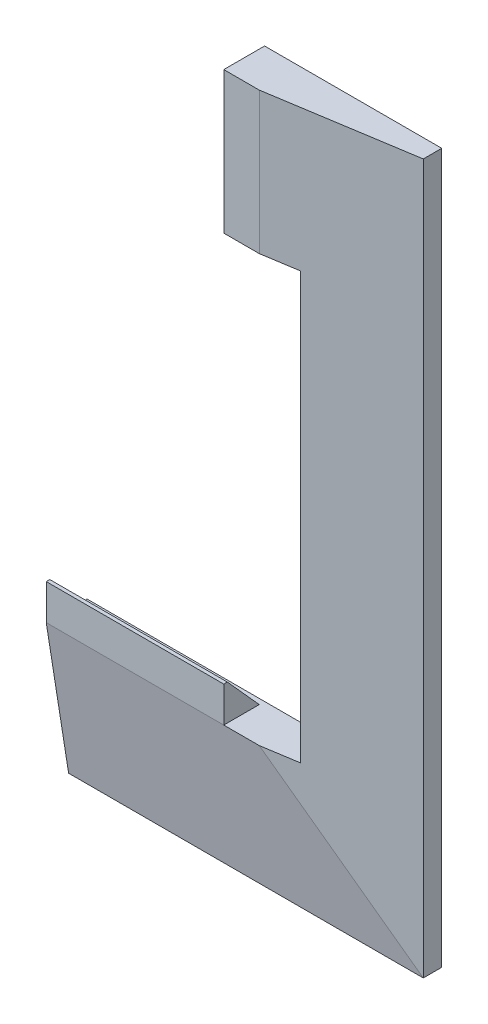
ISO-10303-21;
HEADER;
FILE_DESCRIPTION(('STEP AP214'),'2;1');
FILE_NAME('part.step','',(''),(''),'','','');
FILE_SCHEMA(('AUTOMOTIVE_DESIGN { 1 0 10303 214 1 1 1 1 }'));
ENDSEC;
DATA;
#1=APPLICATION_CONTEXT('core data for automotive mechanical design processes');
#2=APPLICATION_PROTOCOL_DEFINITION('international standard','automotive_design',2000,#1);
#3=PRODUCT_CONTEXT('',#1,'mechanical');
#4=PRODUCT('Part','Part','',(#3));
#5=PRODUCT_RELATED_PRODUCT_CATEGORY('part','',(#4));
#6=PRODUCT_DEFINITION_FORMATION('','',#4);
#7=PRODUCT_DEFINITION_CONTEXT('part definition',#1,'design');
#8=PRODUCT_DEFINITION('design','',#6,#7);
#9=PRODUCT_DEFINITION_SHAPE('','',#8);
#10=(LENGTH_UNIT() NAMED_UNIT(*) SI_UNIT(.MILLI.,.METRE.));
#11=(NAMED_UNIT(*) PLANE_ANGLE_UNIT() SI_UNIT($,.RADIAN.));
#12=(NAMED_UNIT(*) SI_UNIT($,.STERADIAN.) SOLID_ANGLE_UNIT());
#13=UNCERTAINTY_MEASURE_WITH_UNIT(LENGTH_MEASURE(1.E-05),#10,'distance_accuracy_value','');
#14=(GEOMETRIC_REPRESENTATION_CONTEXT(3) GLOBAL_UNCERTAINTY_ASSIGNED_CONTEXT((#13)) GLOBAL_UNIT_ASSIGNED_CONTEXT((#10,
#11,#12)) REPRESENTATION_CONTEXT('',''));
#15=CARTESIAN_POINT('',(0.,0.,0.));
#16=DIRECTION('',(0.,0.,1.));
#17=DIRECTION('',(1.,0.,0.));
#18=AXIS2_PLACEMENT_3D('',#15,#16,#17);
#19=CARTESIAN_POINT('',(53.4329718987957,83.245366469038,5.2));
#20=DIRECTION('',(1.,0.,0.));
#21=DIRECTION('',(0.,-1.,0.));
#22=AXIS2_PLACEMENT_3D('',#19,#20,#21);
#23=PLANE('',#22);
#24=DIRECTION('',(0.,-0.987762965329069,-0.155962573473011));
#25=VECTOR('',#24,1.);
#26=CARTESIAN_POINT('',(53.4329718987957,-76.654633530962,11.5));
#27=LINE('',#26,#25);
#28=CARTESIAN_POINT('',(53.4329718987957,-76.654633530962,11.5));
#29=VERTEX_POINT('',#28);
#30=CARTESIAN_POINT('',(53.4329718987958,-116.554633530962,5.2));
#31=VERTEX_POINT('',#30);
#32=EDGE_CURVE('E580',#29,#31,#27,.T.);
#33=ORIENTED_EDGE('',*,*,#32,.F.);
#34=DIRECTION('',(0.,1.,0.));
#35=VECTOR('',#34,1.);
#36=CARTESIAN_POINT('',(53.4329718987957,-66.654633530962,11.5));
#37=LINE('',#36,#35);
#38=CARTESIAN_POINT('',(53.4329718987957,-66.654633530962,11.5));
#39=VERTEX_POINT('',#38);
#40=EDGE_CURVE('E268',#29,#39,#37,.T.);
#41=ORIENTED_EDGE('',*,*,#40,.T.);
#42=DIRECTION('',(0.,0.,-1.));
#43=VECTOR('',#42,1.);
#44=CARTESIAN_POINT('',(53.4329718987957,-66.654633530962,10.5));
#45=LINE('',#44,#43);
#46=CARTESIAN_POINT('',(53.4329718987957,-66.654633530962,10.5));
#47=VERTEX_POINT('',#46);
#48=EDGE_CURVE('E235',#39,#47,#45,.T.);
#49=ORIENTED_EDGE('',*,*,#48,.T.);
#50=DIRECTION('',(0.,-0.743294146247167,-0.668964731622449));
#51=VECTOR('',#50,1.);
#52=CARTESIAN_POINT('',(53.4329718987957,-76.654633530962,1.5));
#53=LINE('',#52,#51);
#54=CARTESIAN_POINT('',(53.4329718987957,-76.654633530962,1.5));
#55=VERTEX_POINT('',#54);
#56=EDGE_CURVE('E257',#47,#55,#53,.T.);
#57=ORIENTED_EDGE('',*,*,#56,.T.);
#58=DIRECTION('',(0.,0.,-1.));
#59=VECTOR('',#58,1.);
#60=CARTESIAN_POINT('',(53.4329718987957,-76.654633530962,5.2));
#61=LINE('',#60,#59);
#62=CARTESIAN_POINT('',(53.4329718987957,-76.654633530962,0.));
#63=VERTEX_POINT('',#62);
#64=EDGE_CURVE('E439',#55,#63,#61,.T.);
#65=ORIENTED_EDGE('',*,*,#64,.T.);
#66=DIRECTION('',(0.,1.,0.));
#67=VECTOR('',#66,1.);
#68=CARTESIAN_POINT('',(53.4329718987957,-76.654633530962,0.));
#69=LINE('',#68,#67);
#70=CARTESIAN_POINT('',(53.4329718987958,-116.554633530962,0.));
#71=VERTEX_POINT('',#70);
#72=EDGE_CURVE('E527',#71,#63,#69,.T.);
#73=ORIENTED_EDGE('',*,*,#72,.F.);
#74=DIRECTION('',(0.,0.,-1.));
#75=VECTOR('',#74,1.);
#76=CARTESIAN_POINT('',(53.4329718987958,-116.554633530962,5.2));
#77=LINE('',#76,#75);
#78=EDGE_CURVE('E443',#31,#71,#77,.T.);
#79=ORIENTED_EDGE('',*,*,#78,.F.);
#80=EDGE_LOOP('',(#33,#41,#49,#57,#65,#73,#79));
#81=FACE_BOUND('',#80,.T.);
#82=ADVANCED_FACE('F61',(#81),#23,.F.);
#83=CARTESIAN_POINT('',(71.9758043168466,0.,11.5));
#84=DIRECTION('',(0.,0.,-1.));
#85=DIRECTION('',(1.,0.,0.));
#86=AXIS2_PLACEMENT_3D('',#83,#84,#85);
#87=PLANE('',#86);
#88=DIRECTION('',(1.,0.,0.));
#89=VECTOR('',#88,1.);
#90=CARTESIAN_POINT('',(71.9758043168466,43.345366469038,11.5));
#91=LINE('',#90,#89);
#92=CARTESIAN_POINT('',(103.432971898796,43.345366469038,11.5));
#93=VERTEX_POINT('',#92);
#94=CARTESIAN_POINT('',(113.432971898796,43.345366469038,11.5));
#95=VERTEX_POINT('',#94);
#96=EDGE_CURVE('E362',#93,#95,#91,.T.);
#97=ORIENTED_EDGE('',*,*,#96,.T.);
#98=CARTESIAN_POINT('',(113.432971898796,83.245366469038,11.5));
#99=DIRECTION('',(0.,-1.,0.));
#100=VECTOR('',#99,1.);
#101=LINE('',#98,#100);
#102=CARTESIAN_POINT('',(113.432971898796,83.245366469038,11.5));
#103=VERTEX_POINT('',#102);
#104=EDGE_CURVE('E591',#103,#95,#101,.T.);
#105=ORIENTED_EDGE('',*,*,#104,.F.);
#106=CARTESIAN_POINT('',(103.432971898796,83.245366469038,11.5));
#107=DIRECTION('',(1.,0.,0.));
#108=VECTOR('',#107,1.);
#109=LINE('',#106,#108);
#110=CARTESIAN_POINT('',(103.432971898796,83.245366469038,11.5));
#111=VERTEX_POINT('',#110);
#112=EDGE_CURVE('E426',#111,#103,#109,.T.);
#113=ORIENTED_EDGE('',*,*,#112,.F.);
#114=DIRECTION('',(0.,-1.,0.));
#115=VECTOR('',#114,1.);
#116=CARTESIAN_POINT('',(103.432971898796,83.245366469038,11.5));
#117=LINE('',#116,#115);
#118=EDGE_CURVE('E279',#111,#93,#117,.T.);
#119=ORIENTED_EDGE('',*,*,#118,.T.);
#120=EDGE_LOOP('',(#97,#105,#113,#119));
#121=FACE_BOUND('',#120,.T.);
#122=ADVANCED_FACE('F499',(#121),#87,.F.);
#123=CARTESIAN_POINT('',(74.7558435282994,0.,17.6069150058678));
#124=DIRECTION('',(0.155962573473011,0.,0.987762965329069));
#125=DIRECTION('',(-0.987762965329069,0.,0.155962573473011));
#126=AXIS2_PLACEMENT_3D('',#123,#124,#125);
#127=PLANE('',#126);
#128=DIRECTION('',(0.,-1.,0.));
#129=VECTOR('',#128,1.);
#130=CARTESIAN_POINT('',(123.432971898796,0.,9.92105263157894));
#131=LINE('',#130,#129);
#132=CARTESIAN_POINT('',(123.432971898796,43.345366469038,9.92105263157894));
#133=VERTEX_POINT('',#132);
#134=CARTESIAN_POINT('',(123.432971898796,-76.654633530962,9.92105263157894));
#135=VERTEX_POINT('',#134);
#136=EDGE_CURVE('E459',#133,#135,#131,.T.);
#137=ORIENTED_EDGE('',*,*,#136,.T.);
#138=DIRECTION('',(0.987762965329069,0.,-0.155962573473011));
#139=VECTOR('',#138,1.);
#140=CARTESIAN_POINT('',(74.7558435282994,-76.654633530962,17.6069150058678));
#141=LINE('',#140,#139);
#142=CARTESIAN_POINT('',(113.432971898796,-76.654633530962,11.5));
#143=VERTEX_POINT('',#142);
#144=EDGE_CURVE('E571',#143,#135,#141,.T.);
#145=ORIENTED_EDGE('',*,*,#144,.F.);
#146=DIRECTION('',(0.702740385382544,-0.702740385382543,-0.110959008218296));
#147=VECTOR('',#146,1.);
#148=CARTESIAN_POINT('',(113.432971898796,-76.654633530962,11.5));
#149=LINE('',#148,#147);
#150=CARTESIAN_POINT('',(153.332971898796,-116.554633530962,5.2));
#151=VERTEX_POINT('',#150);
#152=EDGE_CURVE('E539',#143,#151,#149,.T.);
#153=ORIENTED_EDGE('',*,*,#152,.T.);
#154=DIRECTION('',(0.,1.,0.));
#155=VECTOR('',#154,1.);
#156=CARTESIAN_POINT('',(153.332971898796,0.,5.2));
#157=LINE('',#156,#155);
#158=CARTESIAN_POINT('',(153.332971898796,83.245366469038,5.2));
#159=VERTEX_POINT('',#158);
#160=EDGE_CURVE('E470',#159,#151,#157,.F.);
#161=ORIENTED_EDGE('',*,*,#160,.F.);
#162=DIRECTION('',(0.987762965329069,0.,-0.155962573473011));
#163=VECTOR('',#162,1.);
#164=CARTESIAN_POINT('',(113.432971898796,83.245366469038,11.5));
#165=LINE('',#164,#163);
#166=EDGE_CURVE('E535',#103,#159,#165,.T.);
#167=ORIENTED_EDGE('',*,*,#166,.F.);
#168=ORIENTED_EDGE('',*,*,#104,.T.);
#169=DIRECTION('',(-0.987762965329069,0.,0.155962573473011));
#170=VECTOR('',#169,1.);
#171=CARTESIAN_POINT('',(74.7558435282994,43.345366469038,17.6069150058678));
#172=LINE('',#171,#170);
#173=EDGE_CURVE('E636',#133,#95,#172,.T.);
#174=ORIENTED_EDGE('',*,*,#173,.F.);
#175=EDGE_LOOP('',(#137,#145,#153,#161,#167,#168,#174));
#176=FACE_BOUND('',#175,.T.);
#177=ADVANCED_FACE('F517',(#176),#127,.T.);
#178=CARTESIAN_POINT('',(153.332971898796,83.245366469038,5.2));
#179=DIRECTION('',(-1.,0.,0.));
#180=DIRECTION('',(0.,1.,0.));
#181=AXIS2_PLACEMENT_3D('',#178,#179,#180);
#182=PLANE('',#181);
#183=DIRECTION('',(0.,-1.,0.));
#184=VECTOR('',#183,1.);
#185=CARTESIAN_POINT('',(153.332971898796,83.245366469038,0.));
#186=LINE('',#185,#184);
#187=CARTESIAN_POINT('',(153.332971898796,83.245366469038,0.));
#188=VERTEX_POINT('',#187);
#189=CARTESIAN_POINT('',(153.332971898796,-116.554633530962,0.));
#190=VERTEX_POINT('',#189);
#191=EDGE_CURVE('E528',#188,#190,#186,.T.);
#192=ORIENTED_EDGE('',*,*,#191,.F.);
#193=DIRECTION('',(0.,0.,-1.));
#194=VECTOR('',#193,1.);
#195=CARTESIAN_POINT('',(153.332971898796,83.245366469038,5.2));
#196=LINE('',#195,#194);
#197=EDGE_CURVE('E460',#159,#188,#196,.T.);
#198=ORIENTED_EDGE('',*,*,#197,.F.);
#199=ORIENTED_EDGE('',*,*,#160,.T.);
#200=DIRECTION('',(0.,0.,-1.));
#201=VECTOR('',#200,1.);
#202=CARTESIAN_POINT('',(153.332971898796,-116.554633530962,5.2));
#203=LINE('',#202,#201);
#204=EDGE_CURVE('E453',#151,#190,#203,.T.);
#205=ORIENTED_EDGE('',*,*,#204,.T.);
#206=EDGE_LOOP('',(#192,#198,#199,#205));
#207=FACE_BOUND('',#206,.T.);
#208=ADVANCED_FACE('F63',(#207),#182,.F.);
#209=CARTESIAN_POINT('',(153.332971898796,-116.554633530962,5.2));
#210=DIRECTION('',(0.,1.,0.));
#211=DIRECTION('',(1.,0.,0.));
#212=AXIS2_PLACEMENT_3D('',#209,#210,#211);
#213=PLANE('',#212);
#214=DIRECTION('',(-1.,0.,0.));
#215=VECTOR('',#214,1.);
#216=CARTESIAN_POINT('',(153.332971898796,-116.554633530962,0.));
#217=LINE('',#216,#215);
#218=EDGE_CURVE('E520',#190,#71,#217,.T.);
#219=ORIENTED_EDGE('',*,*,#218,.F.);
#220=ORIENTED_EDGE('',*,*,#204,.F.);
#221=DIRECTION('',(-1.,0.,0.));
#222=VECTOR('',#221,1.);
#223=CARTESIAN_POINT('',(71.9758043168466,-116.554633530962,5.2));
#224=LINE('',#223,#222);
#225=EDGE_CURVE('E465',#151,#31,#224,.T.);
#226=ORIENTED_EDGE('',*,*,#225,.T.);
#227=ORIENTED_EDGE('',*,*,#78,.T.);
#228=EDGE_LOOP('',(#219,#220,#226,#227));
#229=FACE_BOUND('',#228,.T.);
#230=ADVANCED_FACE('F510',(#229),#213,.F.);
#231=CARTESIAN_POINT('',(123.432971898796,-76.654633530962,5.2));
#232=DIRECTION('',(0.,-1.,0.));
#233=DIRECTION('',(-1.,0.,0.));
#234=AXIS2_PLACEMENT_3D('',#231,#232,#233);
#235=PLANE('',#234);
#236=ORIENTED_EDGE('',*,*,#64,.F.);
#237=DIRECTION('',(-1.,0.,0.));
#238=VECTOR('',#237,1.);
#239=CARTESIAN_POINT('',(103.432971898796,-76.654633530962,1.5));
#240=LINE('',#239,#238);
#241=CARTESIAN_POINT('',(103.432971898796,-76.654633530962,1.5));
#242=VERTEX_POINT('',#241);
#243=EDGE_CURVE('E270',#242,#55,#240,.T.);
#244=ORIENTED_EDGE('',*,*,#243,.F.);
#245=DIRECTION('',(0.,0.,1.));
#246=VECTOR('',#245,1.);
#247=CARTESIAN_POINT('',(103.432971898796,-76.654633530962,11.5));
#248=LINE('',#247,#246);
#249=CARTESIAN_POINT('',(103.432971898796,-76.654633530962,11.5));
#250=VERTEX_POINT('',#249);
#251=EDGE_CURVE('E241',#242,#250,#248,.T.);
#252=ORIENTED_EDGE('',*,*,#251,.T.);
#253=DIRECTION('',(-1.,0.,0.));
#254=VECTOR('',#253,1.);
#255=CARTESIAN_POINT('',(113.432971898796,-76.654633530962,11.5));
#256=LINE('',#255,#254);
#257=EDGE_CURVE('E585',#143,#250,#256,.T.);
#258=ORIENTED_EDGE('',*,*,#257,.F.);
#259=ORIENTED_EDGE('',*,*,#144,.T.);
#260=DIRECTION('',(0.,0.,-1.));
#261=VECTOR('',#260,1.);
#262=CARTESIAN_POINT('',(123.432971898796,-76.654633530962,5.2));
#263=LINE('',#262,#261);
#264=CARTESIAN_POINT('',(123.432971898796,-76.654633530962,0.));
#265=VERTEX_POINT('',#264);
#266=EDGE_CURVE('E444',#135,#265,#263,.T.);
#267=ORIENTED_EDGE('',*,*,#266,.T.);
#268=DIRECTION('',(1.,0.,0.));
#269=VECTOR('',#268,1.);
#270=CARTESIAN_POINT('',(123.432971898796,-76.654633530962,0.));
#271=LINE('',#270,#269);
#272=EDGE_CURVE('E549',#63,#265,#271,.T.);
#273=ORIENTED_EDGE('',*,*,#272,.F.);
#274=EDGE_LOOP('',(#236,#244,#252,#258,#259,#267,#273));
#275=FACE_BOUND('',#274,.T.);
#276=ADVANCED_FACE('F507',(#275),#235,.F.);
#277=CARTESIAN_POINT('',(123.432971898796,43.345366469038,5.2));
#278=DIRECTION('',(1.,0.,0.));
#279=DIRECTION('',(0.,-1.,0.));
#280=AXIS2_PLACEMENT_3D('',#277,#278,#279);
#281=PLANE('',#280);
#282=DIRECTION('',(0.,1.,0.));
#283=VECTOR('',#282,1.);
#284=CARTESIAN_POINT('',(123.432971898796,43.345366469038,0.));
#285=LINE('',#284,#283);
#286=CARTESIAN_POINT('',(123.432971898796,43.345366469038,0.));
#287=VERTEX_POINT('',#286);
#288=EDGE_CURVE('E553',#265,#287,#285,.T.);
#289=ORIENTED_EDGE('',*,*,#288,.F.);
#290=ORIENTED_EDGE('',*,*,#266,.F.);
#291=ORIENTED_EDGE('',*,*,#136,.F.);
#292=DIRECTION('',(0.,0.,-1.));
#293=VECTOR('',#292,1.);
#294=CARTESIAN_POINT('',(123.432971898796,43.345366469038,5.2));
#295=LINE('',#294,#293);
#296=EDGE_CURVE('E464',#133,#287,#295,.T.);
#297=ORIENTED_EDGE('',*,*,#296,.T.);
#298=EDGE_LOOP('',(#289,#290,#291,#297));
#299=FACE_BOUND('',#298,.T.);
#300=CARTESIAN_POINT('',(123.432971898796,3.24536646903798,5.12));
#301=DIRECTION('',(1.,0.,0.));
#302=DIRECTION('',(0.,1.,0.));
#303=AXIS2_PLACEMENT_3D('',#300,#301,#302);
#304=CIRCLE('',#303,1.2);
#305=CARTESIAN_POINT('',(123.432971898796,4.44536646903798,5.12));
#306=VERTEX_POINT('',#305);
#307=EDGE_CURVE('E306',#306,#306,#304,.T.);
#308=ORIENTED_EDGE('',*,*,#307,.T.);
#309=EDGE_LOOP('',(#308));
#310=FACE_BOUND('',#309,.T.);
#311=CARTESIAN_POINT('',(123.432971898796,-36.554633530962,5.12));
#312=DIRECTION('',(1.,0.,0.));
#313=DIRECTION('',(0.,1.,0.));
#314=AXIS2_PLACEMENT_3D('',#311,#312,#313);
#315=CIRCLE('',#314,1.2);
#316=CARTESIAN_POINT('',(123.432971898796,-35.354633530962,5.12));
#317=VERTEX_POINT('',#316);
#318=EDGE_CURVE('E280',#317,#317,#315,.T.);
#319=ORIENTED_EDGE('',*,*,#318,.T.);
#320=EDGE_LOOP('',(#319));
#321=FACE_BOUND('',#320,.T.);
#322=ADVANCED_FACE('F503',(#299,#310,#321),#281,.F.);
#323=CARTESIAN_POINT('',(123.432971898796,43.345366469038,5.2));
#324=DIRECTION('',(0.,1.,0.));
#325=DIRECTION('',(0.,0.,1.));
#326=AXIS2_PLACEMENT_3D('',#323,#324,#325);
#327=PLANE('',#326);
#328=DIRECTION('',(-1.,0.,0.));
#329=VECTOR('',#328,1.);
#330=CARTESIAN_POINT('',(123.432971898796,43.345366469038,0.));
#331=LINE('',#330,#329);
#332=CARTESIAN_POINT('',(103.432971898796,43.345366469038,0.));
#333=VERTEX_POINT('',#332);
#334=EDGE_CURVE('E557',#287,#333,#331,.T.);
#335=ORIENTED_EDGE('',*,*,#334,.F.);
#336=ORIENTED_EDGE('',*,*,#296,.F.);
#337=ORIENTED_EDGE('',*,*,#173,.T.);
#338=ORIENTED_EDGE('',*,*,#96,.F.);
#339=DIRECTION('',(0.,0.,1.));
#340=VECTOR('',#339,1.);
#341=CARTESIAN_POINT('',(103.432971898796,43.345366469038,-12.5));
#342=LINE('',#341,#340);
#343=EDGE_CURVE('E275',#333,#93,#342,.T.);
#344=ORIENTED_EDGE('',*,*,#343,.F.);
#345=EDGE_LOOP('',(#335,#336,#337,#338,#344));
#346=FACE_BOUND('',#345,.T.);
#347=ADVANCED_FACE('F494',(#346),#327,.F.);
#348=CARTESIAN_POINT('',(153.332971898796,83.245366469038,5.2));
#349=DIRECTION('',(0.,-1.,0.));
#350=DIRECTION('',(-1.,0.,0.));
#351=AXIS2_PLACEMENT_3D('',#348,#349,#350);
#352=PLANE('',#351);
#353=ORIENTED_EDGE('',*,*,#112,.T.);
#354=ORIENTED_EDGE('',*,*,#166,.T.);
#355=ORIENTED_EDGE('',*,*,#197,.T.);
#356=DIRECTION('',(1.,0.,0.));
#357=VECTOR('',#356,1.);
#358=CARTESIAN_POINT('',(153.332971898796,83.245366469038,0.));
#359=LINE('',#358,#357);
#360=CARTESIAN_POINT('',(103.432971898796,83.245366469038,0.));
#361=VERTEX_POINT('',#360);
#362=EDGE_CURVE('E476',#361,#188,#359,.T.);
#363=ORIENTED_EDGE('',*,*,#362,.F.);
#364=DIRECTION('',(0.,0.,1.));
#365=VECTOR('',#364,1.);
#366=CARTESIAN_POINT('',(103.432971898796,83.245366469038,-12.5));
#367=LINE('',#366,#365);
#368=EDGE_CURVE('E278',#361,#111,#367,.T.);
#369=ORIENTED_EDGE('',*,*,#368,.T.);
#370=EDGE_LOOP('',(#353,#354,#355,#363,#369));
#371=FACE_BOUND('',#370,.T.);
#372=ADVANCED_FACE('F483',(#371),#352,.F.);
#373=CARTESIAN_POINT('',(71.9758043168466,0.,0.));
#374=DIRECTION('',(0.,0.,1.));
#375=DIRECTION('',(-1.,0.,0.));
#376=AXIS2_PLACEMENT_3D('',#373,#374,#375);
#377=PLANE('',#376);
#378=ORIENTED_EDGE('',*,*,#362,.T.);
#379=ORIENTED_EDGE('',*,*,#191,.T.);
#380=ORIENTED_EDGE('',*,*,#218,.T.);
#381=ORIENTED_EDGE('',*,*,#72,.T.);
#382=ORIENTED_EDGE('',*,*,#272,.T.);
#383=ORIENTED_EDGE('',*,*,#288,.T.);
#384=ORIENTED_EDGE('',*,*,#334,.T.);
#385=DIRECTION('',(0.,-1.,0.));
#386=VECTOR('',#385,1.);
#387=CARTESIAN_POINT('',(103.432971898796,0.,0.));
#388=LINE('',#387,#386);
#389=EDGE_CURVE('E12',#361,#333,#388,.T.);
#390=ORIENTED_EDGE('',*,*,#389,.F.);
#391=EDGE_LOOP('',(#378,#379,#380,#381,#382,#383,#384,#390));
#392=FACE_BOUND('',#391,.T.);
#393=ADVANCED_FACE('F493',(#392),#377,.F.);
#394=CARTESIAN_POINT('',(71.9758043168466,-3.63619378859096,23.0292273277428));
#395=DIRECTION('',(0.,-0.155962573473011,0.987762965329069));
#396=DIRECTION('',(0.,-0.987762965329069,-0.155962573473011));
#397=AXIS2_PLACEMENT_3D('',#394,#395,#396);
#398=PLANE('',#397);
#399=ORIENTED_EDGE('',*,*,#152,.F.);
#400=ORIENTED_EDGE('',*,*,#257,.T.);
#401=DIRECTION('',(-1.,0.,0.));
#402=VECTOR('',#401,1.);
#403=CARTESIAN_POINT('',(103.432971898796,-76.654633530962,11.5));
#404=LINE('',#403,#402);
#405=EDGE_CURVE('E255',#250,#29,#404,.T.);
#406=ORIENTED_EDGE('',*,*,#405,.T.);
#407=ORIENTED_EDGE('',*,*,#32,.T.);
#408=ORIENTED_EDGE('',*,*,#225,.F.);
#409=EDGE_LOOP('',(#399,#400,#406,#407,#408));
#410=FACE_BOUND('',#409,.T.);
#411=ADVANCED_FACE('F584',(#410),#398,.T.);
#412=CARTESIAN_POINT('',(127.232971898796,3.24536646903798,5.12));
#413=DIRECTION('',(-1.,0.,0.));
#414=DIRECTION('',(0.,1.,0.));
#415=AXIS2_PLACEMENT_3D('',#412,#413,#414);
#416=PLANE('',#415);
#417=CARTESIAN_POINT('',(127.232971898796,3.24536646903798,5.12));
#418=DIRECTION('',(1.,0.,0.));
#419=DIRECTION('',(0.,1.,0.));
#420=AXIS2_PLACEMENT_3D('',#417,#418,#419);
#421=CIRCLE('',#420,1.2);
#422=CARTESIAN_POINT('',(127.232971898796,4.44536646903798,5.12));
#423=VERTEX_POINT('',#422);
#424=EDGE_CURVE('E307',#423,#423,#421,.T.);
#425=ORIENTED_EDGE('',*,*,#424,.F.);
#426=EDGE_LOOP('',(#425));
#427=FACE_BOUND('',#426,.T.);
#428=DIRECTION('',(0.,0.5,-0.866025403784438));
#429=VECTOR('',#428,1.);
#430=CARTESIAN_POINT('',(127.232971898796,5.67023759963442,5.12));
#431=LINE('',#430,#429);
#432=CARTESIAN_POINT('',(127.232971898796,4.4578020343362,7.22));
#433=VERTEX_POINT('',#432);
#434=CARTESIAN_POINT('',(127.232971898796,5.67023759963441,5.12));
#435=VERTEX_POINT('',#434);
#436=EDGE_CURVE('E640',#433,#435,#431,.T.);
#437=ORIENTED_EDGE('',*,*,#436,.F.);
#438=DIRECTION('',(0.,1.,0.));
#439=VECTOR('',#438,1.);
#440=CARTESIAN_POINT('',(127.232971898796,4.4578020343362,7.22));
#441=LINE('',#440,#439);
#442=CARTESIAN_POINT('',(127.232971898796,2.03293090373977,7.22));
#443=VERTEX_POINT('',#442);
#444=EDGE_CURVE('E311',#443,#433,#441,.T.);
#445=ORIENTED_EDGE('',*,*,#444,.F.);
#446=DIRECTION('',(0.,0.5,0.866025403784439));
#447=VECTOR('',#446,1.);
#448=CARTESIAN_POINT('',(127.232971898796,2.03293090373977,7.22));
#449=LINE('',#448,#447);
#450=CARTESIAN_POINT('',(127.232971898796,0.820495338441556,5.12));
#451=VERTEX_POINT('',#450);
#452=EDGE_CURVE('E318',#451,#443,#449,.T.);
#453=ORIENTED_EDGE('',*,*,#452,.F.);
#454=DIRECTION('',(0.,-0.5,0.866025403784439));
#455=VECTOR('',#454,1.);
#456=CARTESIAN_POINT('',(127.232971898796,0.820495338441556,5.12));
#457=LINE('',#456,#455);
#458=CARTESIAN_POINT('',(127.232971898796,2.03293090373977,3.02));
#459=VERTEX_POINT('',#458);
#460=EDGE_CURVE('E322',#459,#451,#457,.T.);
#461=ORIENTED_EDGE('',*,*,#460,.F.);
#462=DIRECTION('',(0.,-1.,0.));
#463=VECTOR('',#462,1.);
#464=CARTESIAN_POINT('',(127.232971898796,2.03293090373977,3.02));
#465=LINE('',#464,#463);
#466=CARTESIAN_POINT('',(127.232971898796,4.4578020343362,3.02));
#467=VERTEX_POINT('',#466);
#468=EDGE_CURVE('E326',#467,#459,#465,.T.);
#469=ORIENTED_EDGE('',*,*,#468,.F.);
#470=DIRECTION('',(0.,-0.5,-0.866025403784439));
#471=VECTOR('',#470,1.);
#472=CARTESIAN_POINT('',(127.232971898796,4.4578020343362,3.02));
#473=LINE('',#472,#471);
#474=EDGE_CURVE('E330',#435,#467,#473,.T.);
#475=ORIENTED_EDGE('',*,*,#474,.F.);
#476=EDGE_LOOP('',(#437,#445,#453,#461,#469,#475));
#477=FACE_BOUND('',#476,.T.);
#478=ADVANCED_FACE('F623',(#427,#477),#416,.F.);
#479=CARTESIAN_POINT('',(127.232971898796,3.24536646903798,5.12));
#480=DIRECTION('',(-1.,0.,0.));
#481=DIRECTION('',(0.,1.,0.));
#482=AXIS2_PLACEMENT_3D('',#479,#480,#481);
#483=CYLINDRICAL_SURFACE('',#482,1.2);
#484=ORIENTED_EDGE('',*,*,#424,.T.);
#485=EDGE_LOOP('',(#484));
#486=FACE_BOUND('',#485,.T.);
#487=ORIENTED_EDGE('',*,*,#307,.F.);
#488=EDGE_LOOP('',(#487));
#489=FACE_BOUND('',#488,.T.);
#490=ADVANCED_FACE('F681',(#486,#489),#483,.F.);
#491=CARTESIAN_POINT('',(129.032971898796,0.,0.));
#492=DIRECTION('',(-1.,0.,0.));
#493=DIRECTION('',(0.,0.,-1.));
#494=AXIS2_PLACEMENT_3D('',#491,#492,#493);
#495=PLANE('',#494);
#496=DIRECTION('',(0.,0.5,0.866025403784439));
#497=VECTOR('',#496,1.);
#498=CARTESIAN_POINT('',(129.032971898796,4.4578020343362,3.02));
#499=LINE('',#498,#497);
#500=CARTESIAN_POINT('',(129.032971898796,4.4578020343362,3.02));
#501=VERTEX_POINT('',#500);
#502=CARTESIAN_POINT('',(129.032971898796,5.67023759963442,5.12));
#503=VERTEX_POINT('',#502);
#504=EDGE_CURVE('E340',#501,#503,#499,.T.);
#505=ORIENTED_EDGE('',*,*,#504,.F.);
#506=DIRECTION('',(0.,1.,0.));
#507=VECTOR('',#506,1.);
#508=CARTESIAN_POINT('',(129.032971898796,2.03293090373977,3.02));
#509=LINE('',#508,#507);
#510=CARTESIAN_POINT('',(129.032971898796,2.03293090373977,3.02));
#511=VERTEX_POINT('',#510);
#512=EDGE_CURVE('E380',#511,#501,#509,.T.);
#513=ORIENTED_EDGE('',*,*,#512,.F.);
#514=DIRECTION('',(0.,0.5,-0.866025403784439));
#515=VECTOR('',#514,1.);
#516=CARTESIAN_POINT('',(129.032971898796,0.820495338441556,5.12));
#517=LINE('',#516,#515);
#518=CARTESIAN_POINT('',(129.032971898796,0.820495338441556,5.12));
#519=VERTEX_POINT('',#518);
#520=EDGE_CURVE('E398',#519,#511,#517,.T.);
#521=ORIENTED_EDGE('',*,*,#520,.F.);
#522=DIRECTION('',(0.,-0.5,-0.866025403784439));
#523=VECTOR('',#522,1.);
#524=CARTESIAN_POINT('',(129.032971898796,2.03293090373977,7.22));
#525=LINE('',#524,#523);
#526=CARTESIAN_POINT('',(129.032971898796,2.03293090373977,7.22));
#527=VERTEX_POINT('',#526);
#528=EDGE_CURVE('E402',#527,#519,#525,.T.);
#529=ORIENTED_EDGE('',*,*,#528,.F.);
#530=DIRECTION('',(0.,-1.,0.));
#531=VECTOR('',#530,1.);
#532=CARTESIAN_POINT('',(129.032971898796,4.4578020343362,7.22));
#533=LINE('',#532,#531);
#534=CARTESIAN_POINT('',(129.032971898796,4.4578020343362,7.22));
#535=VERTEX_POINT('',#534);
#536=EDGE_CURVE('E406',#535,#527,#533,.T.);
#537=ORIENTED_EDGE('',*,*,#536,.F.);
#538=DIRECTION('',(0.,-0.5,0.866025403784438));
#539=VECTOR('',#538,1.);
#540=CARTESIAN_POINT('',(129.032971898796,5.67023759963442,5.12));
#541=LINE('',#540,#539);
#542=EDGE_CURVE('E410',#503,#535,#541,.T.);
#543=ORIENTED_EDGE('',*,*,#542,.F.);
#544=EDGE_LOOP('',(#505,#513,#521,#529,#537,#543));
#545=FACE_BOUND('',#544,.T.);
#546=ADVANCED_FACE('F619',(#545),#495,.T.);
#547=CARTESIAN_POINT('',(129.032971898796,5.67023759963442,5.12));
#548=DIRECTION('',(0.,0.866025403784438,0.5));
#549=DIRECTION('',(0.,-0.5,0.866025403784438));
#550=AXIS2_PLACEMENT_3D('',#547,#548,#549);
#551=PLANE('',#550);
#552=ORIENTED_EDGE('',*,*,#436,.T.);
#553=DIRECTION('',(-1.,0.,0.));
#554=VECTOR('',#553,1.);
#555=CARTESIAN_POINT('',(129.032971898796,5.67023759963442,5.12));
#556=LINE('',#555,#554);
#557=EDGE_CURVE('E377',#503,#435,#556,.T.);
#558=ORIENTED_EDGE('',*,*,#557,.F.);
#559=ORIENTED_EDGE('',*,*,#542,.T.);
#560=DIRECTION('',(-1.,0.,0.));
#561=VECTOR('',#560,1.);
#562=CARTESIAN_POINT('',(129.032971898796,4.4578020343362,7.22));
#563=LINE('',#562,#561);
#564=EDGE_CURVE('E381',#535,#433,#563,.T.);
#565=ORIENTED_EDGE('',*,*,#564,.T.);
#566=EDGE_LOOP('',(#552,#558,#559,#565));
#567=FACE_BOUND('',#566,.T.);
#568=ADVANCED_FACE('F713',(#567),#551,.F.);
#569=CARTESIAN_POINT('',(129.032971898796,4.4578020343362,7.22));
#570=DIRECTION('',(0.,0.,1.));
#571=DIRECTION('',(-1.,0.,0.));
#572=AXIS2_PLACEMENT_3D('',#569,#570,#571);
#573=PLANE('',#572);
#574=ORIENTED_EDGE('',*,*,#444,.T.);
#575=ORIENTED_EDGE('',*,*,#564,.F.);
#576=ORIENTED_EDGE('',*,*,#536,.T.);
#577=DIRECTION('',(-1.,0.,0.));
#578=VECTOR('',#577,1.);
#579=CARTESIAN_POINT('',(129.032971898796,2.03293090373977,7.22));
#580=LINE('',#579,#578);
#581=EDGE_CURVE('E384',#527,#443,#580,.T.);
#582=ORIENTED_EDGE('',*,*,#581,.T.);
#583=EDGE_LOOP('',(#574,#575,#576,#582));
#584=FACE_BOUND('',#583,.T.);
#585=ADVANCED_FACE('F716',(#584),#573,.F.);
#586=CARTESIAN_POINT('',(129.032971898796,2.03293090373977,7.22));
#587=DIRECTION('',(0.,-0.866025403784438,0.5));
#588=DIRECTION('',(0.,-0.5,-0.866025403784439));
#589=AXIS2_PLACEMENT_3D('',#586,#587,#588);
#590=PLANE('',#589);
#591=ORIENTED_EDGE('',*,*,#452,.T.);
#592=ORIENTED_EDGE('',*,*,#581,.F.);
#593=ORIENTED_EDGE('',*,*,#528,.T.);
#594=DIRECTION('',(-1.,0.,0.));
#595=VECTOR('',#594,1.);
#596=CARTESIAN_POINT('',(129.032971898796,0.820495338441556,5.12));
#597=LINE('',#596,#595);
#598=EDGE_CURVE('E387',#519,#451,#597,.T.);
#599=ORIENTED_EDGE('',*,*,#598,.T.);
#600=EDGE_LOOP('',(#591,#592,#593,#599));
#601=FACE_BOUND('',#600,.T.);
#602=ADVANCED_FACE('F720',(#601),#590,.F.);
#603=CARTESIAN_POINT('',(129.032971898796,0.820495338441556,5.12));
#604=DIRECTION('',(0.,-0.866025403784439,-0.5));
#605=DIRECTION('',(0.,0.5,-0.866025403784439));
#606=AXIS2_PLACEMENT_3D('',#603,#604,#605);
#607=PLANE('',#606);
#608=ORIENTED_EDGE('',*,*,#460,.T.);
#609=ORIENTED_EDGE('',*,*,#598,.F.);
#610=ORIENTED_EDGE('',*,*,#520,.T.);
#611=DIRECTION('',(-1.,0.,0.));
#612=VECTOR('',#611,1.);
#613=CARTESIAN_POINT('',(129.032971898796,2.03293090373977,3.02));
#614=LINE('',#613,#612);
#615=EDGE_CURVE('E390',#511,#459,#614,.T.);
#616=ORIENTED_EDGE('',*,*,#615,.T.);
#617=EDGE_LOOP('',(#608,#609,#610,#616));
#618=FACE_BOUND('',#617,.T.);
#619=ADVANCED_FACE('F724',(#618),#607,.F.);
#620=CARTESIAN_POINT('',(129.032971898796,2.03293090373977,3.02));
#621=DIRECTION('',(0.,0.,-1.));
#622=DIRECTION('',(0.,1.,0.));
#623=AXIS2_PLACEMENT_3D('',#620,#621,#622);
#624=PLANE('',#623);
#625=ORIENTED_EDGE('',*,*,#468,.T.);
#626=ORIENTED_EDGE('',*,*,#615,.F.);
#627=ORIENTED_EDGE('',*,*,#512,.T.);
#628=DIRECTION('',(-1.,0.,0.));
#629=VECTOR('',#628,1.);
#630=CARTESIAN_POINT('',(129.032971898796,4.4578020343362,3.02));
#631=LINE('',#630,#629);
#632=EDGE_CURVE('E334',#501,#467,#631,.T.);
#633=ORIENTED_EDGE('',*,*,#632,.T.);
#634=EDGE_LOOP('',(#625,#626,#627,#633));
#635=FACE_BOUND('',#634,.T.);
#636=ADVANCED_FACE('F711',(#635),#624,.F.);
#637=CARTESIAN_POINT('',(129.032971898796,4.4578020343362,3.02));
#638=DIRECTION('',(0.,0.866025403784439,-0.5));
#639=DIRECTION('',(0.,0.5,0.866025403784439));
#640=AXIS2_PLACEMENT_3D('',#637,#638,#639);
#641=PLANE('',#640);
#642=ORIENTED_EDGE('',*,*,#474,.T.);
#643=ORIENTED_EDGE('',*,*,#632,.F.);
#644=ORIENTED_EDGE('',*,*,#504,.T.);
#645=ORIENTED_EDGE('',*,*,#557,.T.);
#646=EDGE_LOOP('',(#642,#643,#644,#645));
#647=FACE_BOUND('',#646,.T.);
#648=ADVANCED_FACE('F675',(#647),#641,.F.);
#649=CARTESIAN_POINT('',(127.232971898796,-36.554633530962,5.12));
#650=DIRECTION('',(-1.,0.,0.));
#651=DIRECTION('',(0.,1.,0.));
#652=AXIS2_PLACEMENT_3D('',#649,#650,#651);
#653=PLANE('',#652);
#654=CARTESIAN_POINT('',(127.232971898796,-36.554633530962,5.12));
#655=DIRECTION('',(1.,0.,0.));
#656=DIRECTION('',(0.,1.,0.));
#657=AXIS2_PLACEMENT_3D('',#654,#655,#656);
#658=CIRCLE('',#657,1.2);
#659=CARTESIAN_POINT('',(127.232971898796,-35.354633530962,5.12));
#660=VERTEX_POINT('',#659);
#661=EDGE_CURVE('E285',#660,#660,#658,.T.);
#662=ORIENTED_EDGE('',*,*,#661,.F.);
#663=EDGE_LOOP('',(#662));
#664=FACE_BOUND('',#663,.T.);
#665=DIRECTION('',(0.,0.5,-0.866025403784439));
#666=VECTOR('',#665,1.);
#667=CARTESIAN_POINT('',(127.232971898796,-34.1297624003656,5.11999999999999));
#668=LINE('',#667,#666);
#669=CARTESIAN_POINT('',(127.232971898796,-35.3421979656638,7.22));
#670=VERTEX_POINT('',#669);
#671=CARTESIAN_POINT('',(127.232971898796,-34.1297624003656,5.11999999999999));
#672=VERTEX_POINT('',#671);
#673=EDGE_CURVE('E71',#670,#672,#668,.T.);
#674=ORIENTED_EDGE('',*,*,#673,.F.);
#675=DIRECTION('',(0.,1.,0.));
#676=VECTOR('',#675,1.);
#677=CARTESIAN_POINT('',(127.232971898796,-35.3421979656638,7.22));
#678=LINE('',#677,#676);
#679=CARTESIAN_POINT('',(127.232971898796,-37.7670690962602,7.22));
#680=VERTEX_POINT('',#679);
#681=EDGE_CURVE('E284',#680,#670,#678,.T.);
#682=ORIENTED_EDGE('',*,*,#681,.F.);
#683=DIRECTION('',(0.,0.5,0.866025403784439));
#684=VECTOR('',#683,1.);
#685=CARTESIAN_POINT('',(127.232971898796,-37.7670690962602,7.22));
#686=LINE('',#685,#684);
#687=CARTESIAN_POINT('',(127.232971898796,-38.9795046615584,5.11999999999999));
#688=VERTEX_POINT('',#687);
#689=EDGE_CURVE('E292',#688,#680,#686,.T.);
#690=ORIENTED_EDGE('',*,*,#689,.F.);
#691=DIRECTION('',(0.,-0.500000000000002,0.866025403784438));
#692=VECTOR('',#691,1.);
#693=CARTESIAN_POINT('',(127.232971898796,-38.9795046615584,5.11999999999999));
#694=LINE('',#693,#692);
#695=CARTESIAN_POINT('',(127.232971898796,-37.7670690962602,3.02));
#696=VERTEX_POINT('',#695);
#697=EDGE_CURVE('E296',#696,#688,#694,.T.);
#698=ORIENTED_EDGE('',*,*,#697,.F.);
#699=DIRECTION('',(0.,-1.,0.));
#700=VECTOR('',#699,1.);
#701=CARTESIAN_POINT('',(127.232971898796,-37.7670690962602,3.02));
#702=LINE('',#701,#700);
#703=CARTESIAN_POINT('',(127.232971898796,-35.3421979656638,3.02));
#704=VERTEX_POINT('',#703);
#705=EDGE_CURVE('E300',#704,#696,#702,.T.);
#706=ORIENTED_EDGE('',*,*,#705,.F.);
#707=DIRECTION('',(0.,-0.500000000000002,-0.866025403784438));
#708=VECTOR('',#707,1.);
#709=CARTESIAN_POINT('',(127.232971898796,-35.3421979656638,3.02));
#710=LINE('',#709,#708);
#711=EDGE_CURVE('E303',#672,#704,#710,.T.);
#712=ORIENTED_EDGE('',*,*,#711,.F.);
#713=EDGE_LOOP('',(#674,#682,#690,#698,#706,#712));
#714=FACE_BOUND('',#713,.T.);
#715=ADVANCED_FACE('F671',(#664,#714),#653,.F.);
#716=CARTESIAN_POINT('',(127.232971898796,-36.554633530962,5.12));
#717=DIRECTION('',(-1.,0.,0.));
#718=DIRECTION('',(0.,1.,0.));
#719=AXIS2_PLACEMENT_3D('',#716,#717,#718);
#720=CYLINDRICAL_SURFACE('',#719,1.2);
#721=ORIENTED_EDGE('',*,*,#661,.T.);
#722=EDGE_LOOP('',(#721));
#723=FACE_BOUND('',#722,.T.);
#724=ORIENTED_EDGE('',*,*,#318,.F.);
#725=EDGE_LOOP('',(#724));
#726=FACE_BOUND('',#725,.T.);
#727=ADVANCED_FACE('F674',(#723,#726),#720,.F.);
#728=CARTESIAN_POINT('',(129.032971898796,0.,0.));
#729=DIRECTION('',(-1.,0.,0.));
#730=DIRECTION('',(0.,0.,-1.));
#731=AXIS2_PLACEMENT_3D('',#728,#729,#730);
#732=PLANE('',#731);
#733=DIRECTION('',(0.,0.500000000000002,0.866025403784438));
#734=VECTOR('',#733,1.);
#735=CARTESIAN_POINT('',(129.032971898796,-35.3421979656638,3.02));
#736=LINE('',#735,#734);
#737=CARTESIAN_POINT('',(129.032971898796,-35.3421979656638,3.02));
#738=VERTEX_POINT('',#737);
#739=CARTESIAN_POINT('',(129.032971898796,-34.1297624003656,5.11999999999999));
#740=VERTEX_POINT('',#739);
#741=EDGE_CURVE('E335',#738,#740,#736,.T.);
#742=ORIENTED_EDGE('',*,*,#741,.F.);
#743=DIRECTION('',(0.,1.,0.));
#744=VECTOR('',#743,1.);
#745=CARTESIAN_POINT('',(129.032971898796,-37.7670690962602,3.02));
#746=LINE('',#745,#744);
#747=CARTESIAN_POINT('',(129.032971898796,-37.7670690962602,3.02));
#748=VERTEX_POINT('',#747);
#749=EDGE_CURVE('E356',#748,#738,#746,.T.);
#750=ORIENTED_EDGE('',*,*,#749,.F.);
#751=DIRECTION('',(0.,0.500000000000002,-0.866025403784438));
#752=VECTOR('',#751,1.);
#753=CARTESIAN_POINT('',(129.032971898796,-38.9795046615584,5.11999999999999));
#754=LINE('',#753,#752);
#755=CARTESIAN_POINT('',(129.032971898796,-38.9795046615584,5.11999999999999));
#756=VERTEX_POINT('',#755);
#757=EDGE_CURVE('E352',#756,#748,#754,.T.);
#758=ORIENTED_EDGE('',*,*,#757,.F.);
#759=DIRECTION('',(0.,-0.5,-0.866025403784439));
#760=VECTOR('',#759,1.);
#761=CARTESIAN_POINT('',(129.032971898796,-37.7670690962602,7.22));
#762=LINE('',#761,#760);
#763=CARTESIAN_POINT('',(129.032971898796,-37.7670690962602,7.22));
#764=VERTEX_POINT('',#763);
#765=EDGE_CURVE('E348',#764,#756,#762,.T.);
#766=ORIENTED_EDGE('',*,*,#765,.F.);
#767=DIRECTION('',(0.,-1.,0.));
#768=VECTOR('',#767,1.);
#769=CARTESIAN_POINT('',(129.032971898796,-35.3421979656638,7.22));
#770=LINE('',#769,#768);
#771=CARTESIAN_POINT('',(129.032971898796,-35.3421979656638,7.22));
#772=VERTEX_POINT('',#771);
#773=EDGE_CURVE('E344',#772,#764,#770,.T.);
#774=ORIENTED_EDGE('',*,*,#773,.F.);
#775=DIRECTION('',(0.,-0.5,0.866025403784439));
#776=VECTOR('',#775,1.);
#777=CARTESIAN_POINT('',(129.032971898796,-34.1297624003656,5.11999999999999));
#778=LINE('',#777,#776);
#779=EDGE_CURVE('E339',#740,#772,#778,.T.);
#780=ORIENTED_EDGE('',*,*,#779,.F.);
#781=EDGE_LOOP('',(#742,#750,#758,#766,#774,#780));
#782=FACE_BOUND('',#781,.T.);
#783=ADVANCED_FACE('F679',(#782),#732,.T.);
#784=CARTESIAN_POINT('',(129.032971898796,-34.1297624003656,5.11999999999999));
#785=DIRECTION('',(0.,0.866025403784439,0.5));
#786=DIRECTION('',(0.,-0.5,0.866025403784439));
#787=AXIS2_PLACEMENT_3D('',#784,#785,#786);
#788=PLANE('',#787);
#789=ORIENTED_EDGE('',*,*,#673,.T.);
#790=DIRECTION('',(-1.,0.,0.));
#791=VECTOR('',#790,1.);
#792=CARTESIAN_POINT('',(129.032971898796,-34.1297624003656,5.11999999999999));
#793=LINE('',#792,#791);
#794=EDGE_CURVE('E359',#740,#672,#793,.T.);
#795=ORIENTED_EDGE('',*,*,#794,.F.);
#796=ORIENTED_EDGE('',*,*,#779,.T.);
#797=DIRECTION('',(-1.,0.,0.));
#798=VECTOR('',#797,1.);
#799=CARTESIAN_POINT('',(129.032971898796,-35.3421979656638,7.22));
#800=LINE('',#799,#798);
#801=EDGE_CURVE('E372',#772,#670,#800,.T.);
#802=ORIENTED_EDGE('',*,*,#801,.T.);
#803=EDGE_LOOP('',(#789,#795,#796,#802));
#804=FACE_BOUND('',#803,.T.);
#805=ADVANCED_FACE('F690',(#804),#788,.F.);
#806=CARTESIAN_POINT('',(129.032971898796,-35.3421979656638,7.22));
#807=DIRECTION('',(0.,0.,1.));
#808=DIRECTION('',(0.,-1.,0.));
#809=AXIS2_PLACEMENT_3D('',#806,#807,#808);
#810=PLANE('',#809);
#811=ORIENTED_EDGE('',*,*,#681,.T.);
#812=ORIENTED_EDGE('',*,*,#801,.F.);
#813=ORIENTED_EDGE('',*,*,#773,.T.);
#814=DIRECTION('',(-1.,0.,0.));
#815=VECTOR('',#814,1.);
#816=CARTESIAN_POINT('',(129.032971898796,-37.7670690962602,7.22));
#817=LINE('',#816,#815);
#818=EDGE_CURVE('E369',#764,#680,#817,.T.);
#819=ORIENTED_EDGE('',*,*,#818,.T.);
#820=EDGE_LOOP('',(#811,#812,#813,#819));
#821=FACE_BOUND('',#820,.T.);
#822=ADVANCED_FACE('F701',(#821),#810,.F.);
#823=CARTESIAN_POINT('',(129.032971898796,-37.7670690962602,7.22));
#824=DIRECTION('',(0.,-0.866025403784439,0.5));
#825=DIRECTION('',(0.,-0.5,-0.866025403784439));
#826=AXIS2_PLACEMENT_3D('',#823,#824,#825);
#827=PLANE('',#826);
#828=ORIENTED_EDGE('',*,*,#689,.T.);
#829=ORIENTED_EDGE('',*,*,#818,.F.);
#830=ORIENTED_EDGE('',*,*,#765,.T.);
#831=DIRECTION('',(-1.,0.,0.));
#832=VECTOR('',#831,1.);
#833=CARTESIAN_POINT('',(129.032971898796,-38.9795046615584,5.11999999999999));
#834=LINE('',#833,#832);
#835=EDGE_CURVE('E366',#756,#688,#834,.T.);
#836=ORIENTED_EDGE('',*,*,#835,.T.);
#837=EDGE_LOOP('',(#828,#829,#830,#836));
#838=FACE_BOUND('',#837,.T.);
#839=ADVANCED_FACE('F697',(#838),#827,.F.);
#840=CARTESIAN_POINT('',(129.032971898796,-38.9795046615584,5.11999999999999));
#841=DIRECTION('',(0.,-0.866025403784438,-0.500000000000002));
#842=DIRECTION('',(0.,0.500000000000002,-0.866025403784438));
#843=AXIS2_PLACEMENT_3D('',#840,#841,#842);
#844=PLANE('',#843);
#845=ORIENTED_EDGE('',*,*,#697,.T.);
#846=ORIENTED_EDGE('',*,*,#835,.F.);
#847=ORIENTED_EDGE('',*,*,#757,.T.);
#848=DIRECTION('',(-1.,0.,0.));
#849=VECTOR('',#848,1.);
#850=CARTESIAN_POINT('',(129.032971898796,-37.7670690962602,3.02));
#851=LINE('',#850,#849);
#852=EDGE_CURVE('E363',#748,#696,#851,.T.);
#853=ORIENTED_EDGE('',*,*,#852,.T.);
#854=EDGE_LOOP('',(#845,#846,#847,#853));
#855=FACE_BOUND('',#854,.T.);
#856=ADVANCED_FACE('F694',(#855),#844,.F.);
#857=CARTESIAN_POINT('',(129.032971898796,-37.7670690962602,3.02));
#858=DIRECTION('',(0.,0.,-1.));
#859=DIRECTION('',(0.,1.,0.));
#860=AXIS2_PLACEMENT_3D('',#857,#858,#859);
#861=PLANE('',#860);
#862=ORIENTED_EDGE('',*,*,#705,.T.);
#863=ORIENTED_EDGE('',*,*,#852,.F.);
#864=ORIENTED_EDGE('',*,*,#749,.T.);
#865=DIRECTION('',(-1.,0.,0.));
#866=VECTOR('',#865,1.);
#867=CARTESIAN_POINT('',(129.032971898796,-35.3421979656638,3.02));
#868=LINE('',#867,#866);
#869=EDGE_CURVE('E85',#738,#704,#868,.T.);
#870=ORIENTED_EDGE('',*,*,#869,.T.);
#871=EDGE_LOOP('',(#862,#863,#864,#870));
#872=FACE_BOUND('',#871,.T.);
#873=ADVANCED_FACE('F666',(#872),#861,.F.);
#874=CARTESIAN_POINT('',(129.032971898796,-35.3421979656638,3.02));
#875=DIRECTION('',(0.,0.866025403784438,-0.500000000000002));
#876=DIRECTION('',(0.,0.500000000000002,0.866025403784438));
#877=AXIS2_PLACEMENT_3D('',#874,#875,#876);
#878=PLANE('',#877);
#879=ORIENTED_EDGE('',*,*,#711,.T.);
#880=ORIENTED_EDGE('',*,*,#869,.F.);
#881=ORIENTED_EDGE('',*,*,#741,.T.);
#882=ORIENTED_EDGE('',*,*,#794,.T.);
#883=EDGE_LOOP('',(#879,#880,#881,#882));
#884=FACE_BOUND('',#883,.T.);
#885=ADVANCED_FACE('F658',(#884),#878,.F.);
#886=CARTESIAN_POINT('',(103.432971898796,83.245366469038,-12.5));
#887=DIRECTION('',(1.,0.,0.));
#888=DIRECTION('',(0.,-1.,0.));
#889=AXIS2_PLACEMENT_3D('',#886,#887,#888);
#890=PLANE('',#889);
#891=ORIENTED_EDGE('',*,*,#368,.F.);
#892=ORIENTED_EDGE('',*,*,#389,.T.);
#893=ORIENTED_EDGE('',*,*,#343,.T.);
#894=ORIENTED_EDGE('',*,*,#118,.F.);
#895=EDGE_LOOP('',(#891,#892,#893,#894));
#896=FACE_BOUND('',#895,.T.);
#897=ADVANCED_FACE('F656',(#896),#890,.F.);
#898=CARTESIAN_POINT('',(103.432971898796,-66.654633530962,11.5));
#899=DIRECTION('',(0.,0.,1.));
#900=DIRECTION('',(1.,0.,0.));
#901=AXIS2_PLACEMENT_3D('',#898,#899,#900);
#902=PLANE('',#901);
#903=ORIENTED_EDGE('',*,*,#40,.F.);
#904=ORIENTED_EDGE('',*,*,#405,.F.);
#905=DIRECTION('',(0.,1.,0.));
#906=VECTOR('',#905,1.);
#907=CARTESIAN_POINT('',(103.432971898796,-66.654633530962,11.5));
#908=LINE('',#907,#906);
#909=CARTESIAN_POINT('',(103.432971898796,-66.654633530962,11.5));
#910=VERTEX_POINT('',#909);
#911=EDGE_CURVE('E248',#250,#910,#908,.T.);
#912=ORIENTED_EDGE('',*,*,#911,.T.);
#913=DIRECTION('',(-1.,0.,0.));
#914=VECTOR('',#913,1.);
#915=CARTESIAN_POINT('',(103.432971898796,-66.654633530962,11.5));
#916=LINE('',#915,#914);
#917=EDGE_CURVE('E230',#910,#39,#916,.T.);
#918=ORIENTED_EDGE('',*,*,#917,.T.);
#919=EDGE_LOOP('',(#903,#904,#912,#918));
#920=FACE_BOUND('',#919,.T.);
#921=ADVANCED_FACE('F253',(#920),#902,.T.);
#922=CARTESIAN_POINT('',(103.432971898796,-76.654633530962,1.5));
#923=DIRECTION('',(0.,0.668964731622449,-0.743294146247167));
#924=DIRECTION('',(0.,0.743294146247167,0.668964731622449));
#925=AXIS2_PLACEMENT_3D('',#922,#923,#924);
#926=PLANE('',#925);
#927=ORIENTED_EDGE('',*,*,#56,.F.);
#928=DIRECTION('',(-1.,0.,0.));
#929=VECTOR('',#928,1.);
#930=CARTESIAN_POINT('',(103.432971898796,-66.654633530962,10.5));
#931=LINE('',#930,#929);
#932=CARTESIAN_POINT('',(103.432971898796,-66.654633530962,10.5));
#933=VERTEX_POINT('',#932);
#934=EDGE_CURVE('E240',#933,#47,#931,.T.);
#935=ORIENTED_EDGE('',*,*,#934,.F.);
#936=DIRECTION('',(0.,-0.743294146247167,-0.668964731622449));
#937=VECTOR('',#936,1.);
#938=CARTESIAN_POINT('',(103.432971898796,-76.654633530962,1.5));
#939=LINE('',#938,#937);
#940=EDGE_CURVE('E250',#933,#242,#939,.T.);
#941=ORIENTED_EDGE('',*,*,#940,.T.);
#942=ORIENTED_EDGE('',*,*,#243,.T.);
#943=EDGE_LOOP('',(#927,#935,#941,#942));
#944=FACE_BOUND('',#943,.T.);
#945=ADVANCED_FACE('F578',(#944),#926,.T.);
#946=CARTESIAN_POINT('',(103.432971898796,-66.654633530962,10.5));
#947=DIRECTION('',(0.,1.,0.));
#948=DIRECTION('',(-1.,0.,0.));
#949=AXIS2_PLACEMENT_3D('',#946,#947,#948);
#950=PLANE('',#949);
#951=ORIENTED_EDGE('',*,*,#48,.F.);
#952=ORIENTED_EDGE('',*,*,#917,.F.);
#953=DIRECTION('',(0.,0.,-1.));
#954=VECTOR('',#953,1.);
#955=CARTESIAN_POINT('',(103.432971898796,-66.654633530962,10.5));
#956=LINE('',#955,#954);
#957=EDGE_CURVE('E233',#910,#933,#956,.T.);
#958=ORIENTED_EDGE('',*,*,#957,.T.);
#959=ORIENTED_EDGE('',*,*,#934,.T.);
#960=EDGE_LOOP('',(#951,#952,#958,#959));
#961=FACE_BOUND('',#960,.T.);
#962=ADVANCED_FACE('F232',(#961),#950,.T.);
#963=CARTESIAN_POINT('',(103.432971898796,0.,0.));
#964=DIRECTION('',(1.,0.,0.));
#965=DIRECTION('',(0.,0.,-1.));
#966=AXIS2_PLACEMENT_3D('',#963,#964,#965);
#967=PLANE('',#966);
#968=ORIENTED_EDGE('',*,*,#911,.F.);
#969=ORIENTED_EDGE('',*,*,#251,.F.);
#970=ORIENTED_EDGE('',*,*,#940,.F.);
#971=ORIENTED_EDGE('',*,*,#957,.F.);
#972=EDGE_LOOP('',(#968,#969,#970,#971));
#973=FACE_BOUND('',#972,.T.);
#974=ADVANCED_FACE('F246',(#973),#967,.T.);
#975=CLOSED_SHELL('',(#82,#122,#177,#208,#230,#276,#322,#347,#372,#393,#411,#478,#490,#546,#568,
#585,#602,#619,#636,#648,#715,#727,#783,#805,#822,#839,#856,#873,#885,#897,#921,#945,#962,#974));
#976=MANIFOLD_SOLID_BREP('B2',#975);
#977=ADVANCED_BREP_SHAPE_REPRESENTATION('',(#18,#976),#14);
#978=SHAPE_DEFINITION_REPRESENTATION(#9,#977);
ENDSEC;
END-ISO-10303-21;
